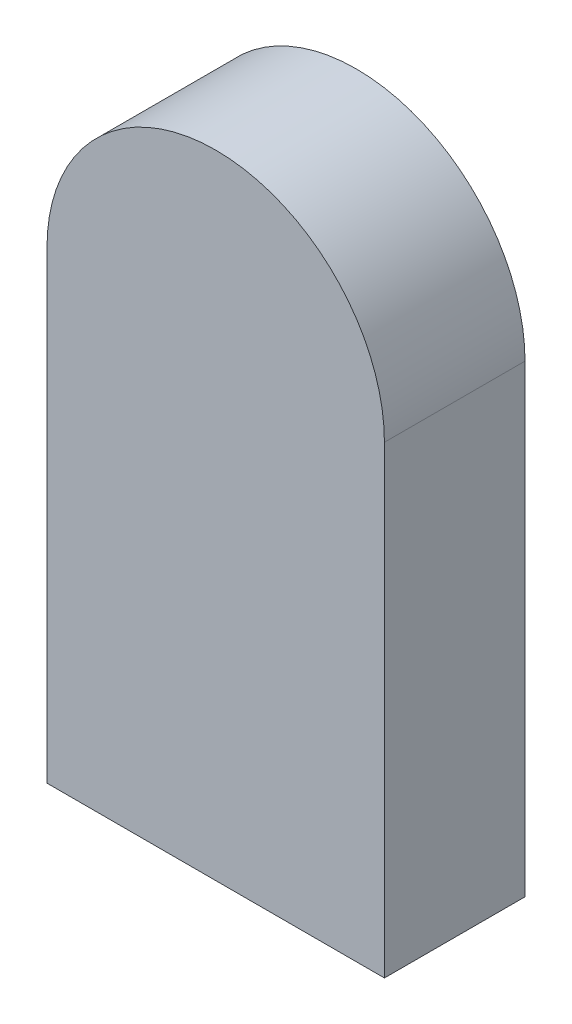
ISO-10303-21;
HEADER;
FILE_DESCRIPTION(('STEP AP214'),'2;1');
FILE_NAME('part.step','',(''),(''),'','','');
FILE_SCHEMA(('AUTOMOTIVE_DESIGN { 1 0 10303 214 1 1 1 1 }'));
ENDSEC;
DATA;
#1=APPLICATION_CONTEXT('core data for automotive mechanical design processes');
#2=APPLICATION_PROTOCOL_DEFINITION('international standard','automotive_design',2000,#1);
#3=PRODUCT_CONTEXT('',#1,'mechanical');
#4=PRODUCT('Part','Part','',(#3));
#5=PRODUCT_RELATED_PRODUCT_CATEGORY('part','',(#4));
#6=PRODUCT_DEFINITION_FORMATION('','',#4);
#7=PRODUCT_DEFINITION_CONTEXT('part definition',#1,'design');
#8=PRODUCT_DEFINITION('design','',#6,#7);
#9=PRODUCT_DEFINITION_SHAPE('','',#8);
#10=(LENGTH_UNIT() NAMED_UNIT(*) SI_UNIT(.MILLI.,.METRE.));
#11=(NAMED_UNIT(*) PLANE_ANGLE_UNIT() SI_UNIT($,.RADIAN.));
#12=(NAMED_UNIT(*) SI_UNIT($,.STERADIAN.) SOLID_ANGLE_UNIT());
#13=UNCERTAINTY_MEASURE_WITH_UNIT(LENGTH_MEASURE(1.E-05),#10,'distance_accuracy_value','');
#14=(GEOMETRIC_REPRESENTATION_CONTEXT(3) GLOBAL_UNCERTAINTY_ASSIGNED_CONTEXT((#13)) GLOBAL_UNIT_ASSIGNED_CONTEXT((#10,
#11,#12)) REPRESENTATION_CONTEXT('',''));
#15=CARTESIAN_POINT('',(0.,0.,0.));
#16=DIRECTION('',(0.,0.,1.));
#17=DIRECTION('',(1.,0.,0.));
#18=AXIS2_PLACEMENT_3D('',#15,#16,#17);
#19=CARTESIAN_POINT('',(3.13,-4.05,0.));
#20=DIRECTION('',(0.,1.,0.));
#21=DIRECTION('',(1.,0.,0.));
#22=AXIS2_PLACEMENT_3D('',#19,#20,#21);
#23=PLANE('',#22);
#24=DIRECTION('',(1.,0.,0.));
#25=VECTOR('',#24,1.);
#26=CARTESIAN_POINT('',(3.13,-4.05,0.));
#27=LINE('',#26,#25);
#28=CARTESIAN_POINT('',(3.13,-4.05,0.));
#29=VERTEX_POINT('',#28);
#30=CARTESIAN_POINT('',(3.37,-4.05,0.));
#31=VERTEX_POINT('',#30);
#32=EDGE_CURVE('E11',#29,#31,#27,.T.);
#33=ORIENTED_EDGE('',*,*,#32,.T.);
#34=DIRECTION('',(0.,0.,1.));
#35=VECTOR('',#34,1.);
#36=CARTESIAN_POINT('',(3.37,-4.05,0.));
#37=LINE('',#36,#35);
#38=CARTESIAN_POINT('',(3.37,-4.05,0.1));
#39=VERTEX_POINT('',#38);
#40=EDGE_CURVE('E24',#31,#39,#37,.T.);
#41=ORIENTED_EDGE('',*,*,#40,.T.);
#42=DIRECTION('',(1.,0.,0.));
#43=VECTOR('',#42,1.);
#44=CARTESIAN_POINT('',(3.13,-4.05,0.1));
#45=LINE('',#44,#43);
#46=CARTESIAN_POINT('',(3.13,-4.05,0.1));
#47=VERTEX_POINT('',#46);
#48=EDGE_CURVE('E87',#47,#39,#45,.T.);
#49=ORIENTED_EDGE('',*,*,#48,.F.);
#50=DIRECTION('',(0.,0.,1.));
#51=VECTOR('',#50,1.);
#52=CARTESIAN_POINT('',(3.13,-4.05,0.));
#53=LINE('',#52,#51);
#54=EDGE_CURVE('E36',#29,#47,#53,.T.);
#55=ORIENTED_EDGE('',*,*,#54,.F.);
#56=EDGE_LOOP('',(#33,#41,#49,#55));
#57=FACE_BOUND('',#56,.T.);
#58=ADVANCED_FACE('F17',(#57),#23,.F.);
#59=CARTESIAN_POINT('',(3.37,-4.05,0.));
#60=DIRECTION('',(-1.,0.,0.));
#61=DIRECTION('',(0.,1.,0.));
#62=AXIS2_PLACEMENT_3D('',#59,#60,#61);
#63=PLANE('',#62);
#64=DIRECTION('',(0.,1.,0.));
#65=VECTOR('',#64,1.);
#66=CARTESIAN_POINT('',(3.37,-4.05,0.));
#67=LINE('',#66,#65);
#68=CARTESIAN_POINT('',(3.37,-3.72,0.));
#69=VERTEX_POINT('',#68);
#70=EDGE_CURVE('E84',#31,#69,#67,.T.);
#71=ORIENTED_EDGE('',*,*,#70,.T.);
#72=DIRECTION('',(0.,0.,1.));
#73=VECTOR('',#72,1.);
#74=CARTESIAN_POINT('',(3.37,-3.72,0.));
#75=LINE('',#74,#73);
#76=CARTESIAN_POINT('',(3.37,-3.72,0.1));
#77=VERTEX_POINT('',#76);
#78=EDGE_CURVE('E82',#69,#77,#75,.T.);
#79=ORIENTED_EDGE('',*,*,#78,.T.);
#80=DIRECTION('',(0.,1.,0.));
#81=VECTOR('',#80,1.);
#82=CARTESIAN_POINT('',(3.37,-4.05,0.1));
#83=LINE('',#82,#81);
#84=EDGE_CURVE('E72',#39,#77,#83,.T.);
#85=ORIENTED_EDGE('',*,*,#84,.F.);
#86=ORIENTED_EDGE('',*,*,#40,.F.);
#87=EDGE_LOOP('',(#71,#79,#85,#86));
#88=FACE_BOUND('',#87,.T.);
#89=ADVANCED_FACE('F89',(#88),#63,.F.);
#90=CARTESIAN_POINT('',(3.25,-3.72,0.));
#91=DIRECTION('',(0.,0.,-1.));
#92=DIRECTION('',(1.,0.,0.));
#93=AXIS2_PLACEMENT_3D('',#90,#91,#92);
#94=CYLINDRICAL_SURFACE('',#93,0.12);
#95=CARTESIAN_POINT('',(3.25,-3.72,0.));
#96=DIRECTION('',(0.,0.,1.));
#97=DIRECTION('',(1.,0.,0.));
#98=AXIS2_PLACEMENT_3D('',#95,#96,#97);
#99=CIRCLE('',#98,0.12);
#100=CARTESIAN_POINT('',(3.13,-3.72,0.));
#101=VERTEX_POINT('',#100);
#102=EDGE_CURVE('E62',#69,#101,#99,.T.);
#103=ORIENTED_EDGE('',*,*,#102,.T.);
#104=DIRECTION('',(0.,0.,1.));
#105=VECTOR('',#104,1.);
#106=CARTESIAN_POINT('',(3.13,-3.72,0.));
#107=LINE('',#106,#105);
#108=CARTESIAN_POINT('',(3.13,-3.72,0.1));
#109=VERTEX_POINT('',#108);
#110=EDGE_CURVE('E57',#101,#109,#107,.T.);
#111=ORIENTED_EDGE('',*,*,#110,.T.);
#112=CARTESIAN_POINT('',(3.25,-3.72,0.1));
#113=DIRECTION('',(0.,0.,1.));
#114=DIRECTION('',(1.,0.,0.));
#115=AXIS2_PLACEMENT_3D('',#112,#113,#114);
#116=CIRCLE('',#115,0.12);
#117=EDGE_CURVE('E60',#77,#109,#116,.T.);
#118=ORIENTED_EDGE('',*,*,#117,.F.);
#119=ORIENTED_EDGE('',*,*,#78,.F.);
#120=EDGE_LOOP('',(#103,#111,#118,#119));
#121=FACE_BOUND('',#120,.T.);
#122=ADVANCED_FACE('F59',(#121),#94,.T.);
#123=CARTESIAN_POINT('',(3.13,-4.05,0.));
#124=DIRECTION('',(-1.,0.,0.));
#125=DIRECTION('',(0.,1.,0.));
#126=AXIS2_PLACEMENT_3D('',#123,#124,#125);
#127=PLANE('',#126);
#128=ORIENTED_EDGE('',*,*,#54,.T.);
#129=DIRECTION('',(0.,1.,0.));
#130=VECTOR('',#129,1.);
#131=CARTESIAN_POINT('',(3.13,-4.05,0.1));
#132=LINE('',#131,#130);
#133=EDGE_CURVE('E71',#47,#109,#132,.T.);
#134=ORIENTED_EDGE('',*,*,#133,.T.);
#135=ORIENTED_EDGE('',*,*,#110,.F.);
#136=DIRECTION('',(0.,1.,0.));
#137=VECTOR('',#136,1.);
#138=CARTESIAN_POINT('',(3.13,-4.05,0.));
#139=LINE('',#138,#137);
#140=EDGE_CURVE('E76',#29,#101,#139,.T.);
#141=ORIENTED_EDGE('',*,*,#140,.F.);
#142=EDGE_LOOP('',(#128,#134,#135,#141));
#143=FACE_BOUND('',#142,.T.);
#144=ADVANCED_FACE('F75',(#143),#127,.T.);
#145=CARTESIAN_POINT('',(3.25,-3.849490847913,0.));
#146=DIRECTION('',(0.,0.,1.));
#147=DIRECTION('',(1.,0.,0.));
#148=AXIS2_PLACEMENT_3D('',#145,#146,#147);
#149=PLANE('',#148);
#150=ORIENTED_EDGE('',*,*,#140,.T.);
#151=ORIENTED_EDGE('',*,*,#102,.F.);
#152=ORIENTED_EDGE('',*,*,#70,.F.);
#153=ORIENTED_EDGE('',*,*,#32,.F.);
#154=EDGE_LOOP('',(#150,#151,#152,#153));
#155=FACE_BOUND('',#154,.T.);
#156=ADVANCED_FACE('F91',(#155),#149,.F.);
#157=CARTESIAN_POINT('',(3.25,-3.849490847913,0.1));
#158=DIRECTION('',(0.,0.,1.));
#159=DIRECTION('',(1.,0.,0.));
#160=AXIS2_PLACEMENT_3D('',#157,#158,#159);
#161=PLANE('',#160);
#162=ORIENTED_EDGE('',*,*,#48,.T.);
#163=ORIENTED_EDGE('',*,*,#84,.T.);
#164=ORIENTED_EDGE('',*,*,#117,.T.);
#165=ORIENTED_EDGE('',*,*,#133,.F.);
#166=EDGE_LOOP('',(#162,#163,#164,#165));
#167=FACE_BOUND('',#166,.T.);
#168=ADVANCED_FACE('F70',(#167),#161,.T.);
#169=CLOSED_SHELL('',(#58,#89,#122,#144,#156,#168));
#170=MANIFOLD_SOLID_BREP('B1',#169);
#171=ADVANCED_BREP_SHAPE_REPRESENTATION('',(#18,#170),#14);
#172=SHAPE_DEFINITION_REPRESENTATION(#9,#171);
ENDSEC;
END-ISO-10303-21;
